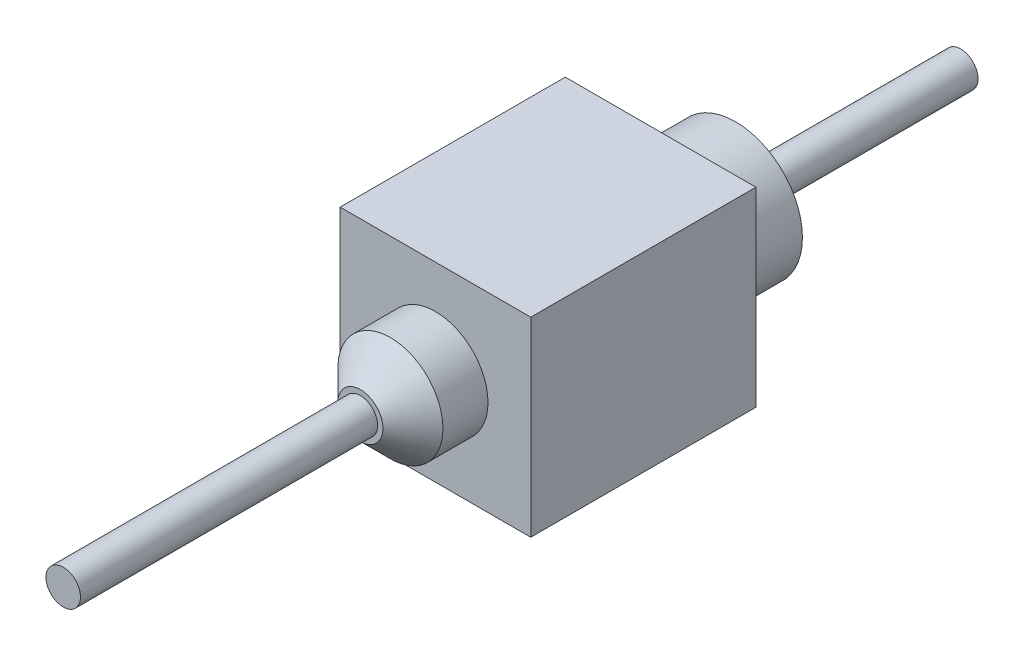
ISO-10303-21;
HEADER;
FILE_DESCRIPTION(('STEP AP214'),'2;1');
FILE_NAME('part.step','',(''),(''),'','','');
FILE_SCHEMA(('AUTOMOTIVE_DESIGN { 1 0 10303 214 1 1 1 1 }'));
ENDSEC;
DATA;
#1=APPLICATION_CONTEXT('core data for automotive mechanical design processes');
#2=APPLICATION_PROTOCOL_DEFINITION('international standard','automotive_design',2000,#1);
#3=PRODUCT_CONTEXT('',#1,'mechanical');
#4=PRODUCT('Part','Part','',(#3));
#5=PRODUCT_RELATED_PRODUCT_CATEGORY('part','',(#4));
#6=PRODUCT_DEFINITION_FORMATION('','',#4);
#7=PRODUCT_DEFINITION_CONTEXT('part definition',#1,'design');
#8=PRODUCT_DEFINITION('design','',#6,#7);
#9=PRODUCT_DEFINITION_SHAPE('','',#8);
#10=(LENGTH_UNIT() NAMED_UNIT(*) SI_UNIT(.MILLI.,.METRE.));
#11=(NAMED_UNIT(*) PLANE_ANGLE_UNIT() SI_UNIT($,.RADIAN.));
#12=(NAMED_UNIT(*) SI_UNIT($,.STERADIAN.) SOLID_ANGLE_UNIT());
#13=UNCERTAINTY_MEASURE_WITH_UNIT(LENGTH_MEASURE(1.E-05),#10,'distance_accuracy_value','');
#14=(GEOMETRIC_REPRESENTATION_CONTEXT(3) GLOBAL_UNCERTAINTY_ASSIGNED_CONTEXT((#13)) GLOBAL_UNIT_ASSIGNED_CONTEXT((#10,
#11,#12)) REPRESENTATION_CONTEXT('',''));
#15=CARTESIAN_POINT('',(0.,0.,0.));
#16=DIRECTION('',(0.,0.,1.));
#17=DIRECTION('',(1.,0.,0.));
#18=AXIS2_PLACEMENT_3D('',#15,#16,#17);
#19=CARTESIAN_POINT('',(-1.27,-1.27,3.));
#20=DIRECTION('',(1.,0.,0.));
#21=DIRECTION('',(0.,1.,0.));
#22=AXIS2_PLACEMENT_3D('',#19,#20,#21);
#23=PLANE('',#22);
#24=DIRECTION('',(0.,-1.,0.));
#25=VECTOR('',#24,1.);
#26=CARTESIAN_POINT('',(-1.27,-1.27,0.));
#27=LINE('',#26,#25);
#28=CARTESIAN_POINT('',(-1.27,1.27,0.));
#29=VERTEX_POINT('',#28);
#30=CARTESIAN_POINT('',(-1.27,-1.27,0.));
#31=VERTEX_POINT('',#30);
#32=EDGE_CURVE('E104',#29,#31,#27,.T.);
#33=ORIENTED_EDGE('',*,*,#32,.T.);
#34=DIRECTION('',(0.,0.,-1.));
#35=VECTOR('',#34,1.);
#36=CARTESIAN_POINT('',(-1.27,-1.27,3.));
#37=LINE('',#36,#35);
#38=CARTESIAN_POINT('',(-1.27,-1.27,3.));
#39=VERTEX_POINT('',#38);
#40=EDGE_CURVE('E95',#39,#31,#37,.T.);
#41=ORIENTED_EDGE('',*,*,#40,.F.);
#42=DIRECTION('',(0.,-1.,0.));
#43=VECTOR('',#42,1.);
#44=CARTESIAN_POINT('',(-1.27,-1.27,3.));
#45=LINE('',#44,#43);
#46=CARTESIAN_POINT('',(-1.27,1.27,3.));
#47=VERTEX_POINT('',#46);
#48=EDGE_CURVE('E89',#47,#39,#45,.T.);
#49=ORIENTED_EDGE('',*,*,#48,.F.);
#50=DIRECTION('',(0.,0.,-1.));
#51=VECTOR('',#50,1.);
#52=CARTESIAN_POINT('',(-1.27,1.27,3.));
#53=LINE('',#52,#51);
#54=EDGE_CURVE('E100',#47,#29,#53,.T.);
#55=ORIENTED_EDGE('',*,*,#54,.T.);
#56=EDGE_LOOP('',(#33,#41,#49,#55));
#57=FACE_BOUND('',#56,.T.);
#58=ADVANCED_FACE('F35',(#57),#23,.F.);
#59=CARTESIAN_POINT('',(1.27,-1.27,3.));
#60=DIRECTION('',(0.,1.,0.));
#61=DIRECTION('',(-1.,0.,0.));
#62=AXIS2_PLACEMENT_3D('',#59,#60,#61);
#63=PLANE('',#62);
#64=DIRECTION('',(1.,0.,0.));
#65=VECTOR('',#64,1.);
#66=CARTESIAN_POINT('',(1.27,-1.27,0.));
#67=LINE('',#66,#65);
#68=CARTESIAN_POINT('',(1.27,-1.27,0.));
#69=VERTEX_POINT('',#68);
#70=EDGE_CURVE('E94',#31,#69,#67,.T.);
#71=ORIENTED_EDGE('',*,*,#70,.T.);
#72=DIRECTION('',(0.,0.,-1.));
#73=VECTOR('',#72,1.);
#74=CARTESIAN_POINT('',(1.27,-1.27,3.));
#75=LINE('',#74,#73);
#76=CARTESIAN_POINT('',(1.27,-1.27,3.));
#77=VERTEX_POINT('',#76);
#78=EDGE_CURVE('E92',#77,#69,#75,.T.);
#79=ORIENTED_EDGE('',*,*,#78,.F.);
#80=DIRECTION('',(1.,0.,0.));
#81=VECTOR('',#80,1.);
#82=CARTESIAN_POINT('',(1.27,-1.27,3.));
#83=LINE('',#82,#81);
#84=EDGE_CURVE('E84',#39,#77,#83,.T.);
#85=ORIENTED_EDGE('',*,*,#84,.F.);
#86=ORIENTED_EDGE('',*,*,#40,.T.);
#87=EDGE_LOOP('',(#71,#79,#85,#86));
#88=FACE_BOUND('',#87,.T.);
#89=ADVANCED_FACE('F93',(#88),#63,.F.);
#90=CARTESIAN_POINT('',(1.27,-1.27,3.));
#91=DIRECTION('',(-1.,0.,0.));
#92=DIRECTION('',(0.,0.,1.));
#93=AXIS2_PLACEMENT_3D('',#90,#91,#92);
#94=PLANE('',#93);
#95=DIRECTION('',(0.,1.,0.));
#96=VECTOR('',#95,1.);
#97=CARTESIAN_POINT('',(1.27,-1.27,0.));
#98=LINE('',#97,#96);
#99=CARTESIAN_POINT('',(1.27,1.27,0.));
#100=VERTEX_POINT('',#99);
#101=EDGE_CURVE('E70',#69,#100,#98,.T.);
#102=ORIENTED_EDGE('',*,*,#101,.T.);
#103=DIRECTION('',(0.,0.,-1.));
#104=VECTOR('',#103,1.);
#105=CARTESIAN_POINT('',(1.27,1.27,3.));
#106=LINE('',#105,#104);
#107=CARTESIAN_POINT('',(1.27,1.27,3.));
#108=VERTEX_POINT('',#107);
#109=EDGE_CURVE('E96',#108,#100,#106,.T.);
#110=ORIENTED_EDGE('',*,*,#109,.F.);
#111=DIRECTION('',(0.,1.,0.));
#112=VECTOR('',#111,1.);
#113=CARTESIAN_POINT('',(1.27,-1.27,3.));
#114=LINE('',#113,#112);
#115=EDGE_CURVE('E87',#77,#108,#114,.T.);
#116=ORIENTED_EDGE('',*,*,#115,.F.);
#117=ORIENTED_EDGE('',*,*,#78,.T.);
#118=EDGE_LOOP('',(#102,#110,#116,#117));
#119=FACE_BOUND('',#118,.T.);
#120=ADVANCED_FACE('F98',(#119),#94,.F.);
#121=CARTESIAN_POINT('',(1.27,1.27,3.));
#122=DIRECTION('',(0.,-1.,0.));
#123=DIRECTION('',(0.,0.,-1.));
#124=AXIS2_PLACEMENT_3D('',#121,#122,#123);
#125=PLANE('',#124);
#126=DIRECTION('',(-1.,0.,0.));
#127=VECTOR('',#126,1.);
#128=CARTESIAN_POINT('',(1.27,1.27,0.));
#129=LINE('',#128,#127);
#130=EDGE_CURVE('E76',#100,#29,#129,.T.);
#131=ORIENTED_EDGE('',*,*,#130,.T.);
#132=ORIENTED_EDGE('',*,*,#54,.F.);
#133=DIRECTION('',(-1.,0.,0.));
#134=VECTOR('',#133,1.);
#135=CARTESIAN_POINT('',(1.27,1.27,3.));
#136=LINE('',#135,#134);
#137=EDGE_CURVE('E53',#108,#47,#136,.T.);
#138=ORIENTED_EDGE('',*,*,#137,.F.);
#139=ORIENTED_EDGE('',*,*,#109,.T.);
#140=EDGE_LOOP('',(#131,#132,#138,#139));
#141=FACE_BOUND('',#140,.T.);
#142=ADVANCED_FACE('F150',(#141),#125,.F.);
#143=CARTESIAN_POINT('',(0.,0.,3.));
#144=DIRECTION('',(0.,0.,1.));
#145=DIRECTION('',(1.,0.,0.));
#146=AXIS2_PLACEMENT_3D('',#143,#144,#145);
#147=PLANE('',#146);
#148=CARTESIAN_POINT('',(0.,0.,3.));
#149=DIRECTION('',(0.,0.,1.));
#150=DIRECTION('',(1.,0.,0.));
#151=AXIS2_PLACEMENT_3D('',#148,#149,#150);
#152=CIRCLE('',#151,0.7);
#153=CARTESIAN_POINT('',(0.7,0.,3.));
#154=VERTEX_POINT('',#153);
#155=EDGE_CURVE('E124',#154,#154,#152,.T.);
#156=ORIENTED_EDGE('',*,*,#155,.F.);
#157=EDGE_LOOP('',(#156));
#158=FACE_BOUND('',#157,.T.);
#159=ORIENTED_EDGE('',*,*,#48,.T.);
#160=ORIENTED_EDGE('',*,*,#84,.T.);
#161=ORIENTED_EDGE('',*,*,#115,.T.);
#162=ORIENTED_EDGE('',*,*,#137,.T.);
#163=EDGE_LOOP('',(#159,#160,#161,#162));
#164=FACE_BOUND('',#163,.T.);
#165=ADVANCED_FACE('F85',(#158,#164),#147,.T.);
#166=CARTESIAN_POINT('',(0.,0.,0.));
#167=DIRECTION('',(0.,0.,1.));
#168=DIRECTION('',(1.,0.,0.));
#169=AXIS2_PLACEMENT_3D('',#166,#167,#168);
#170=PLANE('',#169);
#171=CARTESIAN_POINT('',(0.,0.,0.));
#172=DIRECTION('',(0.,0.,1.));
#173=DIRECTION('',(1.,0.,0.));
#174=AXIS2_PLACEMENT_3D('',#171,#172,#173);
#175=CIRCLE('',#174,0.89);
#176=CARTESIAN_POINT('',(0.89,0.,0.));
#177=VERTEX_POINT('',#176);
#178=EDGE_CURVE('E114',#177,#177,#175,.F.);
#179=ORIENTED_EDGE('',*,*,#178,.F.);
#180=EDGE_LOOP('',(#179));
#181=FACE_BOUND('',#180,.T.);
#182=ORIENTED_EDGE('',*,*,#32,.F.);
#183=ORIENTED_EDGE('',*,*,#130,.F.);
#184=ORIENTED_EDGE('',*,*,#101,.F.);
#185=ORIENTED_EDGE('',*,*,#70,.F.);
#186=EDGE_LOOP('',(#182,#183,#184,#185));
#187=FACE_BOUND('',#186,.T.);
#188=ADVANCED_FACE('F153',(#181,#187),#170,.F.);
#189=CARTESIAN_POINT('',(0.,0.,-1.));
#190=DIRECTION('',(0.,0.,1.));
#191=DIRECTION('',(1.,0.,0.));
#192=AXIS2_PLACEMENT_3D('',#189,#190,#191);
#193=CYLINDRICAL_SURFACE('',#192,0.89);
#194=CARTESIAN_POINT('',(0.,0.,-1.));
#195=DIRECTION('',(0.,0.,-1.));
#196=DIRECTION('',(-1.,0.,0.));
#197=AXIS2_PLACEMENT_3D('',#194,#195,#196);
#198=CIRCLE('',#197,0.89);
#199=CARTESIAN_POINT('',(-0.89,0.,-1.));
#200=VERTEX_POINT('',#199);
#201=EDGE_CURVE('E118',#200,#200,#198,.T.);
#202=ORIENTED_EDGE('',*,*,#201,.F.);
#203=EDGE_LOOP('',(#202));
#204=FACE_BOUND('',#203,.T.);
#205=ORIENTED_EDGE('',*,*,#178,.T.);
#206=EDGE_LOOP('',(#205));
#207=FACE_BOUND('',#206,.T.);
#208=ADVANCED_FACE('F156',(#204,#207),#193,.T.);
#209=CARTESIAN_POINT('',(0.,0.,-1.));
#210=DIRECTION('',(0.,0.,-1.));
#211=DIRECTION('',(-1.,0.,0.));
#212=AXIS2_PLACEMENT_3D('',#209,#210,#211);
#213=PLANE('',#212);
#214=CARTESIAN_POINT('',(0.,0.,-1.));
#215=DIRECTION('',(0.,0.,-1.));
#216=DIRECTION('',(-1.,0.,0.));
#217=AXIS2_PLACEMENT_3D('',#214,#215,#216);
#218=CIRCLE('',#217,0.23);
#219=CARTESIAN_POINT('',(-0.23,0.,-1.));
#220=VERTEX_POINT('',#219);
#221=EDGE_CURVE('E115',#220,#220,#218,.T.);
#222=ORIENTED_EDGE('',*,*,#221,.F.);
#223=EDGE_LOOP('',(#222));
#224=FACE_BOUND('',#223,.T.);
#225=ORIENTED_EDGE('',*,*,#201,.T.);
#226=EDGE_LOOP('',(#225));
#227=FACE_BOUND('',#226,.T.);
#228=ADVANCED_FACE('F169',(#224,#227),#213,.T.);
#229=CARTESIAN_POINT('',(0.,0.,-4.));
#230=DIRECTION('',(0.,0.,-1.));
#231=DIRECTION('',(-1.,0.,0.));
#232=AXIS2_PLACEMENT_3D('',#229,#230,#231);
#233=PLANE('',#232);
#234=CARTESIAN_POINT('',(0.,0.,-4.));
#235=DIRECTION('',(0.,0.,-1.));
#236=DIRECTION('',(-1.,0.,0.));
#237=AXIS2_PLACEMENT_3D('',#234,#235,#236);
#238=CIRCLE('',#237,0.23);
#239=CARTESIAN_POINT('',(-0.23,0.,-4.));
#240=VERTEX_POINT('',#239);
#241=EDGE_CURVE('E107',#240,#240,#238,.T.);
#242=ORIENTED_EDGE('',*,*,#241,.T.);
#243=EDGE_LOOP('',(#242));
#244=FACE_BOUND('',#243,.T.);
#245=ADVANCED_FACE('F165',(#244),#233,.T.);
#246=CARTESIAN_POINT('',(0.,0.,-4.));
#247=DIRECTION('',(0.,0.,1.));
#248=DIRECTION('',(1.,0.,0.));
#249=AXIS2_PLACEMENT_3D('',#246,#247,#248);
#250=CYLINDRICAL_SURFACE('',#249,0.23);
#251=ORIENTED_EDGE('',*,*,#221,.T.);
#252=EDGE_LOOP('',(#251));
#253=FACE_BOUND('',#252,.T.);
#254=ORIENTED_EDGE('',*,*,#241,.F.);
#255=EDGE_LOOP('',(#254));
#256=FACE_BOUND('',#255,.T.);
#257=ADVANCED_FACE('F161',(#253,#256),#250,.T.);
#258=CARTESIAN_POINT('',(0.,0.,4.));
#259=DIRECTION('',(0.,0.,-1.));
#260=DIRECTION('',(-1.,0.,0.));
#261=AXIS2_PLACEMENT_3D('',#258,#259,#260);
#262=CYLINDRICAL_SURFACE('',#261,0.7);
#263=CARTESIAN_POINT('',(0.,0.,3.6));
#264=DIRECTION('',(0.,0.,1.));
#265=DIRECTION('',(1.,0.,0.));
#266=AXIS2_PLACEMENT_3D('',#263,#264,#265);
#267=CIRCLE('',#266,0.7);
#268=CARTESIAN_POINT('',(0.7,0.,3.6));
#269=VERTEX_POINT('',#268);
#270=EDGE_CURVE('E11',#269,#269,#267,.F.);
#271=ORIENTED_EDGE('',*,*,#270,.T.);
#272=EDGE_LOOP('',(#271));
#273=FACE_BOUND('',#272,.T.);
#274=ORIENTED_EDGE('',*,*,#155,.T.);
#275=EDGE_LOOP('',(#274));
#276=FACE_BOUND('',#275,.T.);
#277=ADVANCED_FACE('F164',(#273,#276),#262,.T.);
#278=CARTESIAN_POINT('',(0.,0.,4.));
#279=DIRECTION('',(0.,0.,1.));
#280=DIRECTION('',(1.,0.,0.));
#281=AXIS2_PLACEMENT_3D('',#278,#279,#280);
#282=PLANE('',#281);
#283=CARTESIAN_POINT('',(0.,0.,4.));
#284=DIRECTION('',(0.,0.,1.));
#285=DIRECTION('',(1.,0.,0.));
#286=AXIS2_PLACEMENT_3D('',#283,#284,#285);
#287=CIRCLE('',#286,0.300000000000002);
#288=CARTESIAN_POINT('',(0.300000000000002,0.,4.));
#289=VERTEX_POINT('',#288);
#290=EDGE_CURVE('E45',#289,#289,#287,.T.);
#291=ORIENTED_EDGE('',*,*,#290,.T.);
#292=EDGE_LOOP('',(#291));
#293=FACE_BOUND('',#292,.T.);
#294=CARTESIAN_POINT('',(0.,0.,4.));
#295=DIRECTION('',(0.,0.,1.));
#296=DIRECTION('',(1.,0.,0.));
#297=AXIS2_PLACEMENT_3D('',#294,#295,#296);
#298=CIRCLE('',#297,0.23);
#299=CARTESIAN_POINT('',(0.23,0.,4.));
#300=VERTEX_POINT('',#299);
#301=EDGE_CURVE('E121',#300,#300,#298,.T.);
#302=ORIENTED_EDGE('',*,*,#301,.F.);
#303=EDGE_LOOP('',(#302));
#304=FACE_BOUND('',#303,.T.);
#305=ADVANCED_FACE('F128',(#293,#304),#282,.T.);
#306=CARTESIAN_POINT('',(0.,0.,7.96));
#307=DIRECTION('',(0.,0.,1.));
#308=DIRECTION('',(1.,0.,0.));
#309=AXIS2_PLACEMENT_3D('',#306,#307,#308);
#310=PLANE('',#309);
#311=CARTESIAN_POINT('',(0.,0.,7.96));
#312=DIRECTION('',(0.,0.,1.));
#313=DIRECTION('',(1.,0.,0.));
#314=AXIS2_PLACEMENT_3D('',#311,#312,#313);
#315=CIRCLE('',#314,0.23);
#316=CARTESIAN_POINT('',(0.23,0.,7.96));
#317=VERTEX_POINT('',#316);
#318=EDGE_CURVE('E123',#317,#317,#315,.T.);
#319=ORIENTED_EDGE('',*,*,#318,.T.);
#320=EDGE_LOOP('',(#319));
#321=FACE_BOUND('',#320,.T.);
#322=ADVANCED_FACE('F137',(#321),#310,.T.);
#323=CARTESIAN_POINT('',(0.,0.,7.96));
#324=DIRECTION('',(0.,0.,-1.));
#325=DIRECTION('',(-1.,0.,0.));
#326=AXIS2_PLACEMENT_3D('',#323,#324,#325);
#327=CYLINDRICAL_SURFACE('',#326,0.23);
#328=ORIENTED_EDGE('',*,*,#301,.T.);
#329=EDGE_LOOP('',(#328));
#330=FACE_BOUND('',#329,.T.);
#331=ORIENTED_EDGE('',*,*,#318,.F.);
#332=EDGE_LOOP('',(#331));
#333=FACE_BOUND('',#332,.T.);
#334=ADVANCED_FACE('F132',(#330,#333),#327,.T.);
#335=CARTESIAN_POINT('',(0.,0.,4.));
#336=DIRECTION('',(0.,0.,-1.));
#337=DIRECTION('',(-1.,0.,0.));
#338=AXIS2_PLACEMENT_3D('',#335,#336,#337);
#339=CONICAL_SURFACE('',#338,0.300000000000002,0.785398163397446);
#340=ORIENTED_EDGE('',*,*,#270,.F.);
#341=EDGE_LOOP('',(#340));
#342=FACE_BOUND('',#341,.T.);
#343=ORIENTED_EDGE('',*,*,#290,.F.);
#344=EDGE_LOOP('',(#343));
#345=FACE_BOUND('',#344,.T.);
#346=ADVANCED_FACE('F38',(#342,#345),#339,.T.);
#347=CLOSED_SHELL('',(#58,#89,#120,#142,#165,#188,#208,#228,#245,#257,#277,#305,#322,#334,#346));
#348=MANIFOLD_SOLID_BREP('B2',#347);
#349=ADVANCED_BREP_SHAPE_REPRESENTATION('',(#18,#348),#14);
#350=SHAPE_DEFINITION_REPRESENTATION(#9,#349);
ENDSEC;
END-ISO-10303-21;
